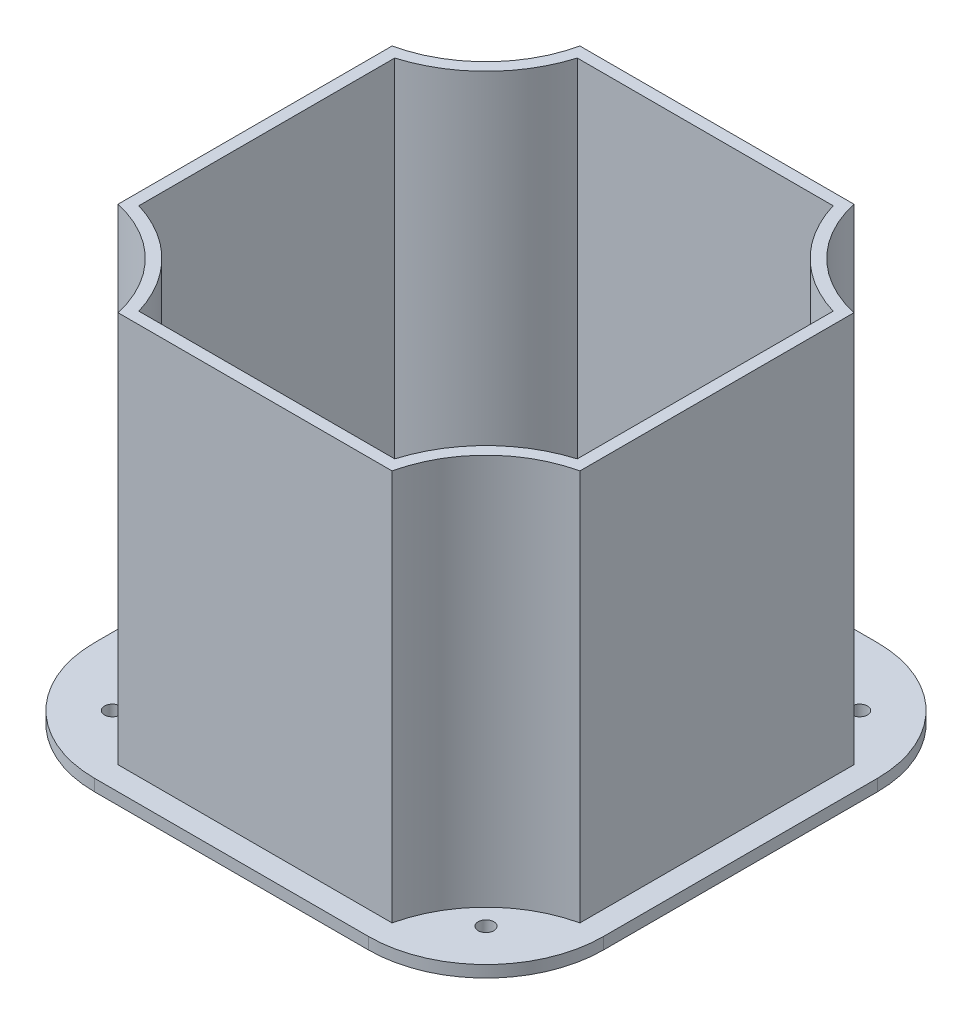
ISO-10303-21;
HEADER;
FILE_DESCRIPTION(('STEP AP214'),'2;1');
FILE_NAME('part.step','',(''),(''),'','','');
FILE_SCHEMA(('AUTOMOTIVE_DESIGN { 1 0 10303 214 1 1 1 1 }'));
ENDSEC;
DATA;
#1=APPLICATION_CONTEXT('core data for automotive mechanical design processes');
#2=APPLICATION_PROTOCOL_DEFINITION('international standard','automotive_design',2000,#1);
#3=PRODUCT_CONTEXT('',#1,'mechanical');
#4=PRODUCT('Part','Part','',(#3));
#5=PRODUCT_RELATED_PRODUCT_CATEGORY('part','',(#4));
#6=PRODUCT_DEFINITION_FORMATION('','',#4);
#7=PRODUCT_DEFINITION_CONTEXT('part definition',#1,'design');
#8=PRODUCT_DEFINITION('design','',#6,#7);
#9=PRODUCT_DEFINITION_SHAPE('','',#8);
#10=(LENGTH_UNIT() NAMED_UNIT(*) SI_UNIT(.MILLI.,.METRE.));
#11=(NAMED_UNIT(*) PLANE_ANGLE_UNIT() SI_UNIT($,.RADIAN.));
#12=(NAMED_UNIT(*) SI_UNIT($,.STERADIAN.) SOLID_ANGLE_UNIT());
#13=UNCERTAINTY_MEASURE_WITH_UNIT(LENGTH_MEASURE(1.E-05),#10,'distance_accuracy_value','');
#14=(GEOMETRIC_REPRESENTATION_CONTEXT(3) GLOBAL_UNCERTAINTY_ASSIGNED_CONTEXT((#13)) GLOBAL_UNIT_ASSIGNED_CONTEXT((#10,
#11,#12)) REPRESENTATION_CONTEXT('',''));
#15=CARTESIAN_POINT('',(0.,0.,0.));
#16=DIRECTION('',(0.,0.,1.));
#17=DIRECTION('',(1.,0.,0.));
#18=AXIS2_PLACEMENT_3D('',#15,#16,#17);
#19=CARTESIAN_POINT('',(18.535245878062,1.5,16.1689695853489));
#20=DIRECTION('',(0.,1.,0.));
#21=DIRECTION('',(0.,0.,1.));
#22=AXIS2_PLACEMENT_3D('',#19,#20,#21);
#23=PLANE('',#22);
#24=CARTESIAN_POINT('',(-22.8287151526167,1.5,-25.1949914453303));
#25=DIRECTION('',(0.,1.,0.));
#26=DIRECTION('',(0.,0.,1.));
#27=AXIS2_PLACEMENT_3D('',#24,#25,#26);
#28=CIRCLE('',#27,1.);
#29=CARTESIAN_POINT('',(-22.8287151526167,1.5,-24.1949914453303));
#30=VERTEX_POINT('',#29);
#31=EDGE_CURVE('E225',#30,#30,#28,.T.);
#32=ORIENTED_EDGE('',*,*,#31,.F.);
#33=EDGE_LOOP('',(#32));
#34=FACE_BOUND('',#33,.T.);
#35=CARTESIAN_POINT('',(24.8992069087408,1.5,22.5329306160279));
#36=DIRECTION('',(0.,1.,0.));
#37=DIRECTION('',(0.,0.,1.));
#38=AXIS2_PLACEMENT_3D('',#35,#36,#37);
#39=CIRCLE('',#38,1.);
#40=CARTESIAN_POINT('',(24.8992069087408,1.5,23.5329306160279));
#41=VERTEX_POINT('',#40);
#42=EDGE_CURVE('E215',#41,#41,#39,.T.);
#43=ORIENTED_EDGE('',*,*,#42,.F.);
#44=EDGE_LOOP('',(#43));
#45=FACE_BOUND('',#44,.T.);
#46=CARTESIAN_POINT('',(18.535245878062,1.5,16.1689695853489));
#47=DIRECTION('',(0.,1.,0.));
#48=DIRECTION('',(0.,0.,1.));
#49=AXIS2_PLACEMENT_3D('',#46,#47,#48);
#50=CIRCLE('',#49,15.);
#51=CARTESIAN_POINT('',(18.5352458780619,1.5,31.1689695853489));
#52=VERTEX_POINT('',#51);
#53=CARTESIAN_POINT('',(33.535245878062,1.5,16.1689695853488));
#54=VERTEX_POINT('',#53);
#55=EDGE_CURVE('E160',#52,#54,#50,.T.);
#56=ORIENTED_EDGE('',*,*,#55,.T.);
#57=DIRECTION('',(0.,0.,-1.));
#58=VECTOR('',#57,1.);
#59=CARTESIAN_POINT('',(33.535245878062,1.5,16.1689695853488));
#60=LINE('',#59,#58);
#61=CARTESIAN_POINT('',(33.535245878062,1.5,-18.831030414651));
#62=VERTEX_POINT('',#61);
#63=EDGE_CURVE('E103',#54,#62,#60,.T.);
#64=ORIENTED_EDGE('',*,*,#63,.T.);
#65=CARTESIAN_POINT('',(18.535245878062,1.5,-18.8310304146511));
#66=DIRECTION('',(0.,1.,0.));
#67=DIRECTION('',(0.,0.,1.));
#68=AXIS2_PLACEMENT_3D('',#65,#66,#67);
#69=CIRCLE('',#68,15.);
#70=CARTESIAN_POINT('',(18.5352458780619,1.5,-33.8310304146511));
#71=VERTEX_POINT('',#70);
#72=EDGE_CURVE('E175',#62,#71,#69,.T.);
#73=ORIENTED_EDGE('',*,*,#72,.T.);
#74=DIRECTION('',(-1.,0.,0.));
#75=VECTOR('',#74,1.);
#76=CARTESIAN_POINT('',(18.5352458780619,1.5,-33.8310304146511));
#77=LINE('',#76,#75);
#78=CARTESIAN_POINT('',(-16.4647541219379,1.5,-33.8310304146511));
#79=VERTEX_POINT('',#78);
#80=EDGE_CURVE('E188',#71,#79,#77,.T.);
#81=ORIENTED_EDGE('',*,*,#80,.T.);
#82=CARTESIAN_POINT('',(-16.464754121938,1.5,-18.8310304146511));
#83=DIRECTION('',(0.,1.,0.));
#84=DIRECTION('',(0.,0.,1.));
#85=AXIS2_PLACEMENT_3D('',#82,#83,#84);
#86=CIRCLE('',#85,15.);
#87=CARTESIAN_POINT('',(-31.464754121938,1.5,-18.831030414651));
#88=VERTEX_POINT('',#87);
#89=EDGE_CURVE('E124',#79,#88,#86,.T.);
#90=ORIENTED_EDGE('',*,*,#89,.T.);
#91=DIRECTION('',(0.,0.,1.));
#92=VECTOR('',#91,1.);
#93=CARTESIAN_POINT('',(-31.464754121938,1.5,-18.831030414651));
#94=LINE('',#93,#92);
#95=CARTESIAN_POINT('',(-31.464754121938,1.5,16.1689695853488));
#96=VERTEX_POINT('',#95);
#97=EDGE_CURVE('E118',#88,#96,#94,.T.);
#98=ORIENTED_EDGE('',*,*,#97,.T.);
#99=CARTESIAN_POINT('',(-16.464754121938,1.5,16.1689695853489));
#100=DIRECTION('',(0.,1.,0.));
#101=DIRECTION('',(0.,0.,1.));
#102=AXIS2_PLACEMENT_3D('',#99,#100,#101);
#103=CIRCLE('',#102,15.);
#104=CARTESIAN_POINT('',(-16.4647541219379,1.5,31.1689695853489));
#105=VERTEX_POINT('',#104);
#106=EDGE_CURVE('E121',#96,#105,#103,.T.);
#107=ORIENTED_EDGE('',*,*,#106,.T.);
#108=DIRECTION('',(1.,0.,0.));
#109=VECTOR('',#108,1.);
#110=CARTESIAN_POINT('',(-16.4647541219379,1.5,31.1689695853489));
#111=LINE('',#110,#109);
#112=EDGE_CURVE('E62',#105,#52,#111,.T.);
#113=ORIENTED_EDGE('',*,*,#112,.T.);
#114=EDGE_LOOP('',(#56,#64,#73,#81,#90,#98,#107,#113));
#115=FACE_BOUND('',#114,.T.);
#116=DIRECTION('',(0.,0.,-1.));
#117=VECTOR('',#116,1.);
#118=CARTESIAN_POINT('',(30.5352458780619,1.5,16.1689695853489));
#119=LINE('',#118,#117);
#120=CARTESIAN_POINT('',(30.5352458780619,1.5,16.1689695853489));
#121=VERTEX_POINT('',#120);
#122=CARTESIAN_POINT('',(30.535245878062,1.5,-18.831030414651));
#123=VERTEX_POINT('',#122);
#124=EDGE_CURVE('E209',#121,#123,#119,.T.);
#125=ORIENTED_EDGE('',*,*,#124,.F.);
#126=CARTESIAN_POINT('',(34.0017247818063,1.5,31.6354484890935));
#127=DIRECTION('',(0.,-1.,0.));
#128=DIRECTION('',(0.,0.,1.));
#129=AXIS2_PLACEMENT_3D('',#126,#127,#128);
#130=CIRCLE('',#129,15.8501875594606);
#131=CARTESIAN_POINT('',(18.5352458780619,1.5,28.1689695853489));
#132=VERTEX_POINT('',#131);
#133=EDGE_CURVE('E212',#132,#121,#130,.T.);
#134=ORIENTED_EDGE('',*,*,#133,.F.);
#135=DIRECTION('',(1.,0.,0.));
#136=VECTOR('',#135,1.);
#137=CARTESIAN_POINT('',(18.5352458780619,1.5,28.1689695853489));
#138=LINE('',#137,#136);
#139=CARTESIAN_POINT('',(-16.4647541219379,1.5,28.1689695853489));
#140=VERTEX_POINT('',#139);
#141=EDGE_CURVE('E53',#140,#132,#138,.T.);
#142=ORIENTED_EDGE('',*,*,#141,.F.);
#143=CARTESIAN_POINT('',(-31.9312330256827,1.5,31.6354484890931));
#144=DIRECTION('',(0.,-1.,0.));
#145=DIRECTION('',(0.,0.,1.));
#146=AXIS2_PLACEMENT_3D('',#143,#144,#145);
#147=CIRCLE('',#146,15.8501875594606);
#148=CARTESIAN_POINT('',(-28.464754121938,1.5,16.1689695853486));
#149=VERTEX_POINT('',#148);
#150=EDGE_CURVE('E195',#149,#140,#147,.T.);
#151=ORIENTED_EDGE('',*,*,#150,.F.);
#152=DIRECTION('',(0.,0.,1.));
#153=VECTOR('',#152,1.);
#154=CARTESIAN_POINT('',(-28.4647541219379,1.5,-18.8310304146514));
#155=LINE('',#154,#153);
#156=CARTESIAN_POINT('',(-28.4647541219379,1.5,-18.8310304146514));
#157=VERTEX_POINT('',#156);
#158=EDGE_CURVE('E197',#157,#149,#155,.T.);
#159=ORIENTED_EDGE('',*,*,#158,.F.);
#160=CARTESIAN_POINT('',(-31.9312330256821,1.5,-34.297509318396));
#161=DIRECTION('',(0.,-1.,0.));
#162=DIRECTION('',(0.,0.,1.));
#163=AXIS2_PLACEMENT_3D('',#160,#161,#162);
#164=CIRCLE('',#163,15.8501875594605);
#165=CARTESIAN_POINT('',(-16.4647541219378,1.5,-30.8310304146511));
#166=VERTEX_POINT('',#165);
#167=EDGE_CURVE('E200',#166,#157,#164,.T.);
#168=ORIENTED_EDGE('',*,*,#167,.F.);
#169=DIRECTION('',(-1.,0.,0.));
#170=VECTOR('',#169,1.);
#171=CARTESIAN_POINT('',(-16.4647541219379,1.5,-30.8310304146511));
#172=LINE('',#171,#170);
#173=CARTESIAN_POINT('',(18.5352458780619,1.5,-30.8310304146511));
#174=VERTEX_POINT('',#173);
#175=EDGE_CURVE('E203',#174,#166,#172,.T.);
#176=ORIENTED_EDGE('',*,*,#175,.F.);
#177=CARTESIAN_POINT('',(34.0017247818065,1.5,-34.2975093183955));
#178=DIRECTION('',(0.,-1.,0.));
#179=DIRECTION('',(0.,0.,1.));
#180=AXIS2_PLACEMENT_3D('',#177,#178,#179);
#181=CIRCLE('',#180,15.8501875594606);
#182=EDGE_CURVE('E206',#123,#174,#181,.T.);
#183=ORIENTED_EDGE('',*,*,#182,.F.);
#184=EDGE_LOOP('',(#125,#134,#142,#151,#159,#168,#176,#183));
#185=FACE_BOUND('',#184,.T.);
#186=CARTESIAN_POINT('',(-22.8287151526171,1.5,22.5329306160277));
#187=DIRECTION('',(0.,1.,0.));
#188=DIRECTION('',(0.,0.,1.));
#189=AXIS2_PLACEMENT_3D('',#186,#187,#188);
#190=CIRCLE('',#189,1.00000000000001);
#191=CARTESIAN_POINT('',(-22.8287151526171,1.5,23.5329306160277));
#192=VERTEX_POINT('',#191);
#193=EDGE_CURVE('E219',#192,#192,#190,.T.);
#194=ORIENTED_EDGE('',*,*,#193,.F.);
#195=EDGE_LOOP('',(#194));
#196=FACE_BOUND('',#195,.T.);
#197=CARTESIAN_POINT('',(24.8992069087409,1.5,-25.1949914453301));
#198=DIRECTION('',(0.,1.,0.));
#199=DIRECTION('',(0.,0.,1.));
#200=AXIS2_PLACEMENT_3D('',#197,#198,#199);
#201=CIRCLE('',#200,1.);
#202=CARTESIAN_POINT('',(24.8992069087409,1.5,-24.1949914453301));
#203=VERTEX_POINT('',#202);
#204=EDGE_CURVE('E231',#203,#203,#201,.T.);
#205=ORIENTED_EDGE('',*,*,#204,.F.);
#206=EDGE_LOOP('',(#205));
#207=FACE_BOUND('',#206,.T.);
#208=ADVANCED_FACE('F38',(#34,#45,#115,#185,#196,#207),#23,.T.);
#209=CARTESIAN_POINT('',(18.535245878062,0.,16.1689695853489));
#210=DIRECTION('',(0.,1.,0.));
#211=DIRECTION('',(0.,0.,1.));
#212=AXIS2_PLACEMENT_3D('',#209,#210,#211);
#213=PLANE('',#212);
#214=CARTESIAN_POINT('',(18.535245878062,0.,16.1689695853489));
#215=DIRECTION('',(0.,1.,0.));
#216=DIRECTION('',(0.,0.,1.));
#217=AXIS2_PLACEMENT_3D('',#214,#215,#216);
#218=CIRCLE('',#217,15.);
#219=CARTESIAN_POINT('',(18.5352458780619,0.,31.1689695853489));
#220=VERTEX_POINT('',#219);
#221=CARTESIAN_POINT('',(33.535245878062,0.,16.1689695853488));
#222=VERTEX_POINT('',#221);
#223=EDGE_CURVE('E145',#220,#222,#218,.T.);
#224=ORIENTED_EDGE('',*,*,#223,.F.);
#225=DIRECTION('',(1.,0.,0.));
#226=VECTOR('',#225,1.);
#227=CARTESIAN_POINT('',(-16.4647541219379,0.,31.1689695853489));
#228=LINE('',#227,#226);
#229=CARTESIAN_POINT('',(-16.4647541219379,0.,31.1689695853489));
#230=VERTEX_POINT('',#229);
#231=EDGE_CURVE('E95',#230,#220,#228,.T.);
#232=ORIENTED_EDGE('',*,*,#231,.F.);
#233=CARTESIAN_POINT('',(-16.464754121938,0.,16.1689695853489));
#234=DIRECTION('',(0.,1.,0.));
#235=DIRECTION('',(0.,0.,1.));
#236=AXIS2_PLACEMENT_3D('',#233,#234,#235);
#237=CIRCLE('',#236,15.);
#238=CARTESIAN_POINT('',(-31.464754121938,0.,16.1689695853488));
#239=VERTEX_POINT('',#238);
#240=EDGE_CURVE('E157',#239,#230,#237,.T.);
#241=ORIENTED_EDGE('',*,*,#240,.F.);
#242=DIRECTION('',(0.,0.,1.));
#243=VECTOR('',#242,1.);
#244=CARTESIAN_POINT('',(-31.464754121938,0.,-18.831030414651));
#245=LINE('',#244,#243);
#246=CARTESIAN_POINT('',(-31.464754121938,0.,-18.831030414651));
#247=VERTEX_POINT('',#246);
#248=EDGE_CURVE('E133',#247,#239,#245,.T.);
#249=ORIENTED_EDGE('',*,*,#248,.F.);
#250=CARTESIAN_POINT('',(-16.464754121938,0.,-18.8310304146511));
#251=DIRECTION('',(0.,1.,0.));
#252=DIRECTION('',(0.,0.,1.));
#253=AXIS2_PLACEMENT_3D('',#250,#251,#252);
#254=CIRCLE('',#253,15.);
#255=CARTESIAN_POINT('',(-16.4647541219379,0.,-33.8310304146511));
#256=VERTEX_POINT('',#255);
#257=EDGE_CURVE('E154',#256,#247,#254,.T.);
#258=ORIENTED_EDGE('',*,*,#257,.F.);
#259=DIRECTION('',(-1.,0.,0.));
#260=VECTOR('',#259,1.);
#261=CARTESIAN_POINT('',(18.5352458780619,0.,-33.8310304146511));
#262=LINE('',#261,#260);
#263=CARTESIAN_POINT('',(18.5352458780619,0.,-33.8310304146511));
#264=VERTEX_POINT('',#263);
#265=EDGE_CURVE('E152',#264,#256,#262,.T.);
#266=ORIENTED_EDGE('',*,*,#265,.F.);
#267=CARTESIAN_POINT('',(18.535245878062,0.,-18.8310304146511));
#268=DIRECTION('',(0.,1.,0.));
#269=DIRECTION('',(0.,0.,1.));
#270=AXIS2_PLACEMENT_3D('',#267,#268,#269);
#271=CIRCLE('',#270,15.);
#272=CARTESIAN_POINT('',(33.535245878062,0.,-18.831030414651));
#273=VERTEX_POINT('',#272);
#274=EDGE_CURVE('E150',#273,#264,#271,.T.);
#275=ORIENTED_EDGE('',*,*,#274,.F.);
#276=DIRECTION('',(0.,0.,-1.));
#277=VECTOR('',#276,1.);
#278=CARTESIAN_POINT('',(33.535245878062,0.,16.1689695853488));
#279=LINE('',#278,#277);
#280=EDGE_CURVE('E148',#222,#273,#279,.T.);
#281=ORIENTED_EDGE('',*,*,#280,.F.);
#282=EDGE_LOOP('',(#224,#232,#241,#249,#258,#266,#275,#281));
#283=FACE_BOUND('',#282,.T.);
#284=CARTESIAN_POINT('',(24.8992069087408,0.,22.5329306160279));
#285=DIRECTION('',(0.,1.,0.));
#286=DIRECTION('',(0.,0.,1.));
#287=AXIS2_PLACEMENT_3D('',#284,#285,#286);
#288=CIRCLE('',#287,1.);
#289=CARTESIAN_POINT('',(24.8992069087408,0.,23.5329306160279));
#290=VERTEX_POINT('',#289);
#291=EDGE_CURVE('E216',#290,#290,#288,.T.);
#292=ORIENTED_EDGE('',*,*,#291,.T.);
#293=EDGE_LOOP('',(#292));
#294=FACE_BOUND('',#293,.T.);
#295=CARTESIAN_POINT('',(-22.8287151526171,0.,22.5329306160277));
#296=DIRECTION('',(0.,1.,0.));
#297=DIRECTION('',(0.,0.,1.));
#298=AXIS2_PLACEMENT_3D('',#295,#296,#297);
#299=CIRCLE('',#298,1.00000000000001);
#300=CARTESIAN_POINT('',(-22.8287151526171,0.,23.5329306160277));
#301=VERTEX_POINT('',#300);
#302=EDGE_CURVE('E222',#301,#301,#299,.T.);
#303=ORIENTED_EDGE('',*,*,#302,.T.);
#304=EDGE_LOOP('',(#303));
#305=FACE_BOUND('',#304,.T.);
#306=CARTESIAN_POINT('',(-22.8287151526167,0.,-25.1949914453303));
#307=DIRECTION('',(0.,1.,0.));
#308=DIRECTION('',(0.,0.,1.));
#309=AXIS2_PLACEMENT_3D('',#306,#307,#308);
#310=CIRCLE('',#309,1.);
#311=CARTESIAN_POINT('',(-22.8287151526167,0.,-24.1949914453303));
#312=VERTEX_POINT('',#311);
#313=EDGE_CURVE('E228',#312,#312,#310,.T.);
#314=ORIENTED_EDGE('',*,*,#313,.T.);
#315=EDGE_LOOP('',(#314));
#316=FACE_BOUND('',#315,.T.);
#317=CARTESIAN_POINT('',(24.8992069087409,0.,-25.1949914453301));
#318=DIRECTION('',(0.,1.,0.));
#319=DIRECTION('',(0.,0.,1.));
#320=AXIS2_PLACEMENT_3D('',#317,#318,#319);
#321=CIRCLE('',#320,1.);
#322=CARTESIAN_POINT('',(24.8992069087409,0.,-24.1949914453301));
#323=VERTEX_POINT('',#322);
#324=EDGE_CURVE('E234',#323,#323,#321,.T.);
#325=ORIENTED_EDGE('',*,*,#324,.T.);
#326=EDGE_LOOP('',(#325));
#327=FACE_BOUND('',#326,.T.);
#328=DIRECTION('',(0.,0.,1.));
#329=VECTOR('',#328,1.);
#330=CARTESIAN_POINT('',(29.0352458780619,0.,15.0112764601735));
#331=LINE('',#330,#329);
#332=CARTESIAN_POINT('',(29.035245878062,0.,-17.6733372894756));
#333=VERTEX_POINT('',#332);
#334=CARTESIAN_POINT('',(29.0352458780619,0.,15.0112764601735));
#335=VERTEX_POINT('',#334);
#336=EDGE_CURVE('E336',#333,#335,#331,.T.);
#337=ORIENTED_EDGE('',*,*,#336,.F.);
#338=CARTESIAN_POINT('',(34.0017247818065,0.,-34.2975093183955));
#339=DIRECTION('',(0.,1.,0.));
#340=DIRECTION('',(0.,0.,1.));
#341=AXIS2_PLACEMENT_3D('',#338,#339,#340);
#342=CIRCLE('',#341,17.3501875594607);
#343=CARTESIAN_POINT('',(17.3775527528865,0.,-29.3310304146511));
#344=VERTEX_POINT('',#343);
#345=EDGE_CURVE('E335',#344,#333,#342,.T.);
#346=ORIENTED_EDGE('',*,*,#345,.F.);
#347=DIRECTION('',(1.,0.,0.));
#348=VECTOR('',#347,1.);
#349=CARTESIAN_POINT('',(17.3775527528865,0.,-29.3310304146511));
#350=LINE('',#349,#348);
#351=CARTESIAN_POINT('',(-15.3070609967623,0.,-29.3310304146511));
#352=VERTEX_POINT('',#351);
#353=EDGE_CURVE('E354',#352,#344,#350,.T.);
#354=ORIENTED_EDGE('',*,*,#353,.F.);
#355=CARTESIAN_POINT('',(-31.9312330256821,0.,-34.297509318396));
#356=DIRECTION('',(0.,1.,0.));
#357=DIRECTION('',(0.,0.,1.));
#358=AXIS2_PLACEMENT_3D('',#355,#356,#357);
#359=CIRCLE('',#358,17.3501875594606);
#360=CARTESIAN_POINT('',(-26.9647541219379,0.,-17.673337289476));
#361=VERTEX_POINT('',#360);
#362=EDGE_CURVE('E351',#361,#352,#359,.T.);
#363=ORIENTED_EDGE('',*,*,#362,.F.);
#364=DIRECTION('',(0.,0.,-1.));
#365=VECTOR('',#364,1.);
#366=CARTESIAN_POINT('',(-26.9647541219379,0.,-17.673337289476));
#367=LINE('',#366,#365);
#368=CARTESIAN_POINT('',(-26.964754121938,0.,15.0112764601731));
#369=VERTEX_POINT('',#368);
#370=EDGE_CURVE('E348',#369,#361,#367,.T.);
#371=ORIENTED_EDGE('',*,*,#370,.F.);
#372=CARTESIAN_POINT('',(-31.9312330256827,0.,31.6354484890931));
#373=DIRECTION('',(0.,1.,0.));
#374=DIRECTION('',(0.,0.,1.));
#375=AXIS2_PLACEMENT_3D('',#372,#373,#374);
#376=CIRCLE('',#375,17.3501875594608);
#377=CARTESIAN_POINT('',(-15.3070609967626,0.,26.6689695853489));
#378=VERTEX_POINT('',#377);
#379=EDGE_CURVE('E345',#378,#369,#376,.T.);
#380=ORIENTED_EDGE('',*,*,#379,.F.);
#381=DIRECTION('',(-1.,0.,0.));
#382=VECTOR('',#381,1.);
#383=CARTESIAN_POINT('',(-15.3070609967626,0.,26.6689695853489));
#384=LINE('',#383,#382);
#385=CARTESIAN_POINT('',(17.3775527528864,0.,26.6689695853489));
#386=VERTEX_POINT('',#385);
#387=EDGE_CURVE('E342',#386,#378,#384,.T.);
#388=ORIENTED_EDGE('',*,*,#387,.F.);
#389=CARTESIAN_POINT('',(34.0017247818063,0.,31.6354484890935));
#390=DIRECTION('',(0.,1.,0.));
#391=DIRECTION('',(0.,0.,1.));
#392=AXIS2_PLACEMENT_3D('',#389,#390,#391);
#393=CIRCLE('',#392,17.3501875594606);
#394=EDGE_CURVE('E339',#335,#386,#393,.T.);
#395=ORIENTED_EDGE('',*,*,#394,.F.);
#396=EDGE_LOOP('',(#337,#346,#354,#363,#371,#380,#388,#395));
#397=FACE_BOUND('',#396,.T.);
#398=ADVANCED_FACE('F179',(#283,#294,#305,#316,#327,#397),#213,.F.);
#399=CARTESIAN_POINT('',(18.535245878062,1.5,16.1689695853489));
#400=DIRECTION('',(0.,-1.,0.));
#401=DIRECTION('',(0.,0.,-1.));
#402=AXIS2_PLACEMENT_3D('',#399,#400,#401);
#403=CYLINDRICAL_SURFACE('',#402,15.);
#404=ORIENTED_EDGE('',*,*,#223,.T.);
#405=DIRECTION('',(0.,-1.,0.));
#406=VECTOR('',#405,1.);
#407=CARTESIAN_POINT('',(33.535245878062,1.5,16.1689695853488));
#408=LINE('',#407,#406);
#409=EDGE_CURVE('E11',#54,#222,#408,.T.);
#410=ORIENTED_EDGE('',*,*,#409,.F.);
#411=ORIENTED_EDGE('',*,*,#55,.F.);
#412=DIRECTION('',(0.,-1.,0.));
#413=VECTOR('',#412,1.);
#414=CARTESIAN_POINT('',(18.5352458780619,1.5,31.1689695853489));
#415=LINE('',#414,#413);
#416=EDGE_CURVE('E141',#52,#220,#415,.T.);
#417=ORIENTED_EDGE('',*,*,#416,.T.);
#418=EDGE_LOOP('',(#404,#410,#411,#417));
#419=FACE_BOUND('',#418,.T.);
#420=ADVANCED_FACE('F40',(#419),#403,.T.);
#421=CARTESIAN_POINT('',(33.535245878062,1.5,16.1689695853488));
#422=DIRECTION('',(-1.,0.,0.));
#423=DIRECTION('',(0.,0.,1.));
#424=AXIS2_PLACEMENT_3D('',#421,#422,#423);
#425=PLANE('',#424);
#426=ORIENTED_EDGE('',*,*,#280,.T.);
#427=DIRECTION('',(0.,-1.,0.));
#428=VECTOR('',#427,1.);
#429=CARTESIAN_POINT('',(33.535245878062,1.5,-18.831030414651));
#430=LINE('',#429,#428);
#431=EDGE_CURVE('E46',#62,#273,#430,.T.);
#432=ORIENTED_EDGE('',*,*,#431,.F.);
#433=ORIENTED_EDGE('',*,*,#63,.F.);
#434=ORIENTED_EDGE('',*,*,#409,.T.);
#435=EDGE_LOOP('',(#426,#432,#433,#434));
#436=FACE_BOUND('',#435,.T.);
#437=ADVANCED_FACE('F530',(#436),#425,.F.);
#438=CARTESIAN_POINT('',(18.535245878062,1.5,-18.8310304146511));
#439=DIRECTION('',(0.,-1.,0.));
#440=DIRECTION('',(0.,0.,-1.));
#441=AXIS2_PLACEMENT_3D('',#438,#439,#440);
#442=CYLINDRICAL_SURFACE('',#441,15.);
#443=ORIENTED_EDGE('',*,*,#274,.T.);
#444=DIRECTION('',(0.,-1.,0.));
#445=VECTOR('',#444,1.);
#446=CARTESIAN_POINT('',(18.5352458780619,1.5,-33.8310304146511));
#447=LINE('',#446,#445);
#448=EDGE_CURVE('E167',#71,#264,#447,.T.);
#449=ORIENTED_EDGE('',*,*,#448,.F.);
#450=ORIENTED_EDGE('',*,*,#72,.F.);
#451=ORIENTED_EDGE('',*,*,#431,.T.);
#452=EDGE_LOOP('',(#443,#449,#450,#451));
#453=FACE_BOUND('',#452,.T.);
#454=ADVANCED_FACE('F173',(#453),#442,.T.);
#455=CARTESIAN_POINT('',(18.5352458780619,1.5,-33.8310304146511));
#456=DIRECTION('',(0.,0.,1.));
#457=DIRECTION('',(1.,0.,0.));
#458=AXIS2_PLACEMENT_3D('',#455,#456,#457);
#459=PLANE('',#458);
#460=ORIENTED_EDGE('',*,*,#265,.T.);
#461=DIRECTION('',(0.,-1.,0.));
#462=VECTOR('',#461,1.);
#463=CARTESIAN_POINT('',(-16.4647541219379,1.5,-33.8310304146511));
#464=LINE('',#463,#462);
#465=EDGE_CURVE('E164',#79,#256,#464,.T.);
#466=ORIENTED_EDGE('',*,*,#465,.F.);
#467=ORIENTED_EDGE('',*,*,#80,.F.);
#468=ORIENTED_EDGE('',*,*,#448,.T.);
#469=EDGE_LOOP('',(#460,#466,#467,#468));
#470=FACE_BOUND('',#469,.T.);
#471=ADVANCED_FACE('F184',(#470),#459,.F.);
#472=CARTESIAN_POINT('',(-16.464754121938,1.5,-18.8310304146511));
#473=DIRECTION('',(0.,-1.,0.));
#474=DIRECTION('',(0.,0.,-1.));
#475=AXIS2_PLACEMENT_3D('',#472,#473,#474);
#476=CYLINDRICAL_SURFACE('',#475,15.);
#477=ORIENTED_EDGE('',*,*,#257,.T.);
#478=DIRECTION('',(0.,-1.,0.));
#479=VECTOR('',#478,1.);
#480=CARTESIAN_POINT('',(-31.464754121938,1.5,-18.831030414651));
#481=LINE('',#480,#479);
#482=EDGE_CURVE('E136',#88,#247,#481,.T.);
#483=ORIENTED_EDGE('',*,*,#482,.F.);
#484=ORIENTED_EDGE('',*,*,#89,.F.);
#485=ORIENTED_EDGE('',*,*,#465,.T.);
#486=EDGE_LOOP('',(#477,#483,#484,#485));
#487=FACE_BOUND('',#486,.T.);
#488=ADVANCED_FACE('F187',(#487),#476,.T.);
#489=CARTESIAN_POINT('',(-31.464754121938,1.5,-18.831030414651));
#490=DIRECTION('',(1.,0.,0.));
#491=DIRECTION('',(0.,0.,-1.));
#492=AXIS2_PLACEMENT_3D('',#489,#490,#491);
#493=PLANE('',#492);
#494=ORIENTED_EDGE('',*,*,#248,.T.);
#495=DIRECTION('',(0.,-1.,0.));
#496=VECTOR('',#495,1.);
#497=CARTESIAN_POINT('',(-31.464754121938,1.5,16.1689695853488));
#498=LINE('',#497,#496);
#499=EDGE_CURVE('E130',#96,#239,#498,.T.);
#500=ORIENTED_EDGE('',*,*,#499,.F.);
#501=ORIENTED_EDGE('',*,*,#97,.F.);
#502=ORIENTED_EDGE('',*,*,#482,.T.);
#503=EDGE_LOOP('',(#494,#500,#501,#502));
#504=FACE_BOUND('',#503,.T.);
#505=ADVANCED_FACE('F131',(#504),#493,.F.);
#506=CARTESIAN_POINT('',(-16.464754121938,1.5,16.1689695853489));
#507=DIRECTION('',(0.,-1.,0.));
#508=DIRECTION('',(0.,0.,-1.));
#509=AXIS2_PLACEMENT_3D('',#506,#507,#508);
#510=CYLINDRICAL_SURFACE('',#509,15.);
#511=ORIENTED_EDGE('',*,*,#240,.T.);
#512=DIRECTION('',(0.,-1.,0.));
#513=VECTOR('',#512,1.);
#514=CARTESIAN_POINT('',(-16.4647541219379,1.5,31.1689695853489));
#515=LINE('',#514,#513);
#516=EDGE_CURVE('E137',#105,#230,#515,.T.);
#517=ORIENTED_EDGE('',*,*,#516,.F.);
#518=ORIENTED_EDGE('',*,*,#106,.F.);
#519=ORIENTED_EDGE('',*,*,#499,.T.);
#520=EDGE_LOOP('',(#511,#517,#518,#519));
#521=FACE_BOUND('',#520,.T.);
#522=ADVANCED_FACE('F139',(#521),#510,.T.);
#523=CARTESIAN_POINT('',(-16.4647541219379,1.5,31.1689695853489));
#524=DIRECTION('',(0.,0.,-1.));
#525=DIRECTION('',(-1.,0.,0.));
#526=AXIS2_PLACEMENT_3D('',#523,#524,#525);
#527=PLANE('',#526);
#528=ORIENTED_EDGE('',*,*,#231,.T.);
#529=ORIENTED_EDGE('',*,*,#416,.F.);
#530=ORIENTED_EDGE('',*,*,#112,.F.);
#531=ORIENTED_EDGE('',*,*,#516,.T.);
#532=EDGE_LOOP('',(#528,#529,#530,#531));
#533=FACE_BOUND('',#532,.T.);
#534=ADVANCED_FACE('F518',(#533),#527,.F.);
#535=CARTESIAN_POINT('',(24.8992069087408,1.5,22.5329306160279));
#536=DIRECTION('',(0.,-1.,0.));
#537=DIRECTION('',(0.,0.,-1.));
#538=AXIS2_PLACEMENT_3D('',#535,#536,#537);
#539=CYLINDRICAL_SURFACE('',#538,1.);
#540=ORIENTED_EDGE('',*,*,#42,.T.);
#541=EDGE_LOOP('',(#540));
#542=FACE_BOUND('',#541,.T.);
#543=ORIENTED_EDGE('',*,*,#291,.F.);
#544=EDGE_LOOP('',(#543));
#545=FACE_BOUND('',#544,.T.);
#546=ADVANCED_FACE('F515',(#542,#545),#539,.F.);
#547=CARTESIAN_POINT('',(-22.8287151526171,1.5,22.5329306160277));
#548=DIRECTION('',(0.,-1.,0.));
#549=DIRECTION('',(0.,0.,-1.));
#550=AXIS2_PLACEMENT_3D('',#547,#548,#549);
#551=CYLINDRICAL_SURFACE('',#550,1.00000000000001);
#552=ORIENTED_EDGE('',*,*,#193,.T.);
#553=EDGE_LOOP('',(#552));
#554=FACE_BOUND('',#553,.T.);
#555=ORIENTED_EDGE('',*,*,#302,.F.);
#556=EDGE_LOOP('',(#555));
#557=FACE_BOUND('',#556,.T.);
#558=ADVANCED_FACE('F575',(#554,#557),#551,.F.);
#559=CARTESIAN_POINT('',(-22.8287151526167,1.5,-25.1949914453303));
#560=DIRECTION('',(0.,-1.,0.));
#561=DIRECTION('',(0.,0.,-1.));
#562=AXIS2_PLACEMENT_3D('',#559,#560,#561);
#563=CYLINDRICAL_SURFACE('',#562,1.);
#564=ORIENTED_EDGE('',*,*,#31,.T.);
#565=EDGE_LOOP('',(#564));
#566=FACE_BOUND('',#565,.T.);
#567=ORIENTED_EDGE('',*,*,#313,.F.);
#568=EDGE_LOOP('',(#567));
#569=FACE_BOUND('',#568,.T.);
#570=ADVANCED_FACE('F563',(#566,#569),#563,.F.);
#571=CARTESIAN_POINT('',(24.8992069087409,1.5,-25.1949914453301));
#572=DIRECTION('',(0.,-1.,0.));
#573=DIRECTION('',(0.,0.,-1.));
#574=AXIS2_PLACEMENT_3D('',#571,#572,#573);
#575=CYLINDRICAL_SURFACE('',#574,1.);
#576=ORIENTED_EDGE('',*,*,#204,.T.);
#577=EDGE_LOOP('',(#576));
#578=FACE_BOUND('',#577,.T.);
#579=ORIENTED_EDGE('',*,*,#324,.F.);
#580=EDGE_LOOP('',(#579));
#581=FACE_BOUND('',#580,.T.);
#582=ADVANCED_FACE('F557',(#578,#581),#575,.F.);
#583=CARTESIAN_POINT('',(-31.9312330256821,51.5,-34.297509318396));
#584=DIRECTION('',(0.,1.,0.));
#585=DIRECTION('',(0.,0.,1.));
#586=AXIS2_PLACEMENT_3D('',#583,#584,#585);
#587=PLANE('',#586);
#588=CARTESIAN_POINT('',(-31.9312330256821,51.5,-34.297509318396));
#589=DIRECTION('',(0.,-1.,0.));
#590=DIRECTION('',(0.,0.,1.));
#591=AXIS2_PLACEMENT_3D('',#588,#589,#590);
#592=CIRCLE('',#591,15.8501875594606);
#593=CARTESIAN_POINT('',(-16.4647541219378,51.5,-30.8310304146511));
#594=VERTEX_POINT('',#593);
#595=CARTESIAN_POINT('',(-28.4647541219379,51.5,-18.8310304146514));
#596=VERTEX_POINT('',#595);
#597=EDGE_CURVE('E284',#594,#596,#592,.T.);
#598=ORIENTED_EDGE('',*,*,#597,.T.);
#599=DIRECTION('',(0.,0.,1.));
#600=VECTOR('',#599,1.);
#601=CARTESIAN_POINT('',(-28.4647541219379,51.5,-18.8310304146514));
#602=LINE('',#601,#600);
#603=CARTESIAN_POINT('',(-28.464754121938,51.5,16.1689695853486));
#604=VERTEX_POINT('',#603);
#605=EDGE_CURVE('E281',#596,#604,#602,.T.);
#606=ORIENTED_EDGE('',*,*,#605,.T.);
#607=CARTESIAN_POINT('',(-31.9312330256827,51.5,31.6354484890931));
#608=DIRECTION('',(0.,-1.,0.));
#609=DIRECTION('',(0.,0.,1.));
#610=AXIS2_PLACEMENT_3D('',#607,#608,#609);
#611=CIRCLE('',#610,15.8501875594607);
#612=CARTESIAN_POINT('',(-16.464754121938,51.5,28.1689695853489));
#613=VERTEX_POINT('',#612);
#614=EDGE_CURVE('E278',#604,#613,#611,.T.);
#615=ORIENTED_EDGE('',*,*,#614,.T.);
#616=DIRECTION('',(1.,0.,0.));
#617=VECTOR('',#616,1.);
#618=CARTESIAN_POINT('',(-16.4647541219379,51.5,28.1689695853489));
#619=LINE('',#618,#617);
#620=CARTESIAN_POINT('',(18.5352458780619,51.5,28.1689695853489));
#621=VERTEX_POINT('',#620);
#622=EDGE_CURVE('E275',#613,#621,#619,.T.);
#623=ORIENTED_EDGE('',*,*,#622,.T.);
#624=CARTESIAN_POINT('',(34.0017247818063,51.5,31.6354484890935));
#625=DIRECTION('',(0.,-1.,0.));
#626=DIRECTION('',(0.,0.,1.));
#627=AXIS2_PLACEMENT_3D('',#624,#625,#626);
#628=CIRCLE('',#627,15.8501875594606);
#629=CARTESIAN_POINT('',(30.5352458780619,51.5,16.168969585349));
#630=VERTEX_POINT('',#629);
#631=EDGE_CURVE('E272',#621,#630,#628,.T.);
#632=ORIENTED_EDGE('',*,*,#631,.T.);
#633=DIRECTION('',(0.,0.,-1.));
#634=VECTOR('',#633,1.);
#635=CARTESIAN_POINT('',(30.5352458780619,51.5,16.1689695853489));
#636=LINE('',#635,#634);
#637=CARTESIAN_POINT('',(30.535245878062,51.5,-18.831030414651));
#638=VERTEX_POINT('',#637);
#639=EDGE_CURVE('E269',#630,#638,#636,.T.);
#640=ORIENTED_EDGE('',*,*,#639,.T.);
#641=CARTESIAN_POINT('',(34.0017247818065,51.5,-34.2975093183955));
#642=DIRECTION('',(0.,-1.,0.));
#643=DIRECTION('',(0.,0.,1.));
#644=AXIS2_PLACEMENT_3D('',#641,#642,#643);
#645=CIRCLE('',#644,15.8501875594607);
#646=CARTESIAN_POINT('',(18.5352458780619,51.5,-30.8310304146511));
#647=VERTEX_POINT('',#646);
#648=EDGE_CURVE('E266',#638,#647,#645,.T.);
#649=ORIENTED_EDGE('',*,*,#648,.T.);
#650=DIRECTION('',(-1.,0.,0.));
#651=VECTOR('',#650,1.);
#652=CARTESIAN_POINT('',(18.5352458780619,51.5,-30.8310304146511));
#653=LINE('',#652,#651);
#654=EDGE_CURVE('E263',#647,#594,#653,.T.);
#655=ORIENTED_EDGE('',*,*,#654,.T.);
#656=EDGE_LOOP('',(#598,#606,#615,#623,#632,#640,#649,#655));
#657=FACE_BOUND('',#656,.T.);
#658=DIRECTION('',(0.,0.,-1.));
#659=VECTOR('',#658,1.);
#660=CARTESIAN_POINT('',(29.0352458780619,51.5,15.0112764601735));
#661=LINE('',#660,#659);
#662=CARTESIAN_POINT('',(29.0352458780619,51.5,15.0112764601735));
#663=VERTEX_POINT('',#662);
#664=CARTESIAN_POINT('',(29.035245878062,51.5,-17.6733372894756));
#665=VERTEX_POINT('',#664);
#666=EDGE_CURVE('E329',#663,#665,#661,.T.);
#667=ORIENTED_EDGE('',*,*,#666,.F.);
#668=CARTESIAN_POINT('',(34.0017247818063,51.5,31.6354484890935));
#669=DIRECTION('',(0.,-1.,0.));
#670=DIRECTION('',(0.,0.,1.));
#671=AXIS2_PLACEMENT_3D('',#668,#669,#670);
#672=CIRCLE('',#671,17.3501875594606);
#673=CARTESIAN_POINT('',(17.3775527528864,51.5,26.6689695853489));
#674=VERTEX_POINT('',#673);
#675=EDGE_CURVE('E332',#674,#663,#672,.T.);
#676=ORIENTED_EDGE('',*,*,#675,.F.);
#677=DIRECTION('',(1.,0.,0.));
#678=VECTOR('',#677,1.);
#679=CARTESIAN_POINT('',(-15.3070609967626,51.5,26.6689695853489));
#680=LINE('',#679,#678);
#681=CARTESIAN_POINT('',(-15.3070609967626,51.5,26.6689695853489));
#682=VERTEX_POINT('',#681);
#683=EDGE_CURVE('E311',#682,#674,#680,.T.);
#684=ORIENTED_EDGE('',*,*,#683,.F.);
#685=CARTESIAN_POINT('',(-31.9312330256827,51.5,31.6354484890931));
#686=DIRECTION('',(0.,-1.,0.));
#687=DIRECTION('',(0.,0.,1.));
#688=AXIS2_PLACEMENT_3D('',#685,#686,#687);
#689=CIRCLE('',#688,17.3501875594608);
#690=CARTESIAN_POINT('',(-26.964754121938,51.5,15.0112764601731));
#691=VERTEX_POINT('',#690);
#692=EDGE_CURVE('E314',#691,#682,#689,.T.);
#693=ORIENTED_EDGE('',*,*,#692,.F.);
#694=DIRECTION('',(0.,0.,1.));
#695=VECTOR('',#694,1.);
#696=CARTESIAN_POINT('',(-26.9647541219379,51.5,-17.673337289476));
#697=LINE('',#696,#695);
#698=CARTESIAN_POINT('',(-26.9647541219379,51.5,-17.673337289476));
#699=VERTEX_POINT('',#698);
#700=EDGE_CURVE('E317',#699,#691,#697,.T.);
#701=ORIENTED_EDGE('',*,*,#700,.F.);
#702=CARTESIAN_POINT('',(-31.9312330256821,51.5,-34.297509318396));
#703=DIRECTION('',(0.,-1.,0.));
#704=DIRECTION('',(0.,0.,1.));
#705=AXIS2_PLACEMENT_3D('',#702,#703,#704);
#706=CIRCLE('',#705,17.3501875594606);
#707=CARTESIAN_POINT('',(-15.3070609967623,51.5,-29.3310304146511));
#708=VERTEX_POINT('',#707);
#709=EDGE_CURVE('E320',#708,#699,#706,.T.);
#710=ORIENTED_EDGE('',*,*,#709,.F.);
#711=DIRECTION('',(-1.,0.,0.));
#712=VECTOR('',#711,1.);
#713=CARTESIAN_POINT('',(17.3775527528865,51.5,-29.3310304146511));
#714=LINE('',#713,#712);
#715=CARTESIAN_POINT('',(17.3775527528865,51.5,-29.3310304146511));
#716=VERTEX_POINT('',#715);
#717=EDGE_CURVE('E323',#716,#708,#714,.T.);
#718=ORIENTED_EDGE('',*,*,#717,.F.);
#719=CARTESIAN_POINT('',(34.0017247818065,51.5,-34.2975093183955));
#720=DIRECTION('',(0.,-1.,0.));
#721=DIRECTION('',(0.,0.,1.));
#722=AXIS2_PLACEMENT_3D('',#719,#720,#721);
#723=CIRCLE('',#722,17.3501875594607);
#724=EDGE_CURVE('E326',#665,#716,#723,.T.);
#725=ORIENTED_EDGE('',*,*,#724,.F.);
#726=EDGE_LOOP('',(#667,#676,#684,#693,#701,#710,#718,#725));
#727=FACE_BOUND('',#726,.T.);
#728=ADVANCED_FACE('F393',(#657,#727),#587,.T.);
#729=CARTESIAN_POINT('',(-31.9312330256821,51.5,-34.297509318396));
#730=DIRECTION('',(0.,-1.,0.));
#731=DIRECTION('',(0.,0.,-1.));
#732=AXIS2_PLACEMENT_3D('',#729,#730,#731);
#733=CYLINDRICAL_SURFACE('',#732,15.8501875594606);
#734=ORIENTED_EDGE('',*,*,#167,.T.);
#735=DIRECTION('',(0.,-1.,0.));
#736=VECTOR('',#735,1.);
#737=CARTESIAN_POINT('',(-28.4647541219379,51.5,-18.8310304146514));
#738=LINE('',#737,#736);
#739=EDGE_CURVE('E237',#596,#157,#738,.T.);
#740=ORIENTED_EDGE('',*,*,#739,.F.);
#741=ORIENTED_EDGE('',*,*,#597,.F.);
#742=DIRECTION('',(0.,-1.,0.));
#743=VECTOR('',#742,1.);
#744=CARTESIAN_POINT('',(-16.4647541219378,51.5,-30.8310304146511));
#745=LINE('',#744,#743);
#746=EDGE_CURVE('E260',#594,#166,#745,.T.);
#747=ORIENTED_EDGE('',*,*,#746,.T.);
#748=EDGE_LOOP('',(#734,#740,#741,#747));
#749=FACE_BOUND('',#748,.T.);
#750=ADVANCED_FACE('F485',(#749),#733,.F.);
#751=CARTESIAN_POINT('',(-28.4647541219379,51.5,-18.8310304146514));
#752=DIRECTION('',(1.,0.,0.));
#753=DIRECTION('',(0.,0.,-1.));
#754=AXIS2_PLACEMENT_3D('',#751,#752,#753);
#755=PLANE('',#754);
#756=ORIENTED_EDGE('',*,*,#158,.T.);
#757=DIRECTION('',(0.,-1.,0.));
#758=VECTOR('',#757,1.);
#759=CARTESIAN_POINT('',(-28.464754121938,51.5,16.1689695853486));
#760=LINE('',#759,#758);
#761=EDGE_CURVE('E242',#604,#149,#760,.T.);
#762=ORIENTED_EDGE('',*,*,#761,.F.);
#763=ORIENTED_EDGE('',*,*,#605,.F.);
#764=ORIENTED_EDGE('',*,*,#739,.T.);
#765=EDGE_LOOP('',(#756,#762,#763,#764));
#766=FACE_BOUND('',#765,.T.);
#767=ADVANCED_FACE('F482',(#766),#755,.F.);
#768=CARTESIAN_POINT('',(-31.9312330256827,51.5,31.6354484890931));
#769=DIRECTION('',(0.,-1.,0.));
#770=DIRECTION('',(0.,0.,-1.));
#771=AXIS2_PLACEMENT_3D('',#768,#769,#770);
#772=CYLINDRICAL_SURFACE('',#771,15.8501875594607);
#773=ORIENTED_EDGE('',*,*,#150,.T.);
#774=DIRECTION('',(0.,-1.,0.));
#775=VECTOR('',#774,1.);
#776=CARTESIAN_POINT('',(-16.464754121938,51.5,28.1689695853489));
#777=LINE('',#776,#775);
#778=EDGE_CURVE('E245',#613,#140,#777,.T.);
#779=ORIENTED_EDGE('',*,*,#778,.F.);
#780=ORIENTED_EDGE('',*,*,#614,.F.);
#781=ORIENTED_EDGE('',*,*,#761,.T.);
#782=EDGE_LOOP('',(#773,#779,#780,#781));
#783=FACE_BOUND('',#782,.T.);
#784=ADVANCED_FACE('F480',(#783),#772,.F.);
#785=CARTESIAN_POINT('',(-16.4647541219379,51.5,28.1689695853489));
#786=DIRECTION('',(0.,0.,-1.));
#787=DIRECTION('',(-1.,0.,0.));
#788=AXIS2_PLACEMENT_3D('',#785,#786,#787);
#789=PLANE('',#788);
#790=ORIENTED_EDGE('',*,*,#141,.T.);
#791=DIRECTION('',(0.,-1.,0.));
#792=VECTOR('',#791,1.);
#793=CARTESIAN_POINT('',(18.5352458780619,51.5,28.1689695853489));
#794=LINE('',#793,#792);
#795=EDGE_CURVE('E248',#621,#132,#794,.T.);
#796=ORIENTED_EDGE('',*,*,#795,.F.);
#797=ORIENTED_EDGE('',*,*,#622,.F.);
#798=ORIENTED_EDGE('',*,*,#778,.T.);
#799=EDGE_LOOP('',(#790,#796,#797,#798));
#800=FACE_BOUND('',#799,.T.);
#801=ADVANCED_FACE('F469',(#800),#789,.F.);
#802=CARTESIAN_POINT('',(34.0017247818063,51.5,31.6354484890935));
#803=DIRECTION('',(0.,-1.,0.));
#804=DIRECTION('',(0.,0.,-1.));
#805=AXIS2_PLACEMENT_3D('',#802,#803,#804);
#806=CYLINDRICAL_SURFACE('',#805,15.8501875594606);
#807=ORIENTED_EDGE('',*,*,#133,.T.);
#808=DIRECTION('',(0.,-1.,0.));
#809=VECTOR('',#808,1.);
#810=CARTESIAN_POINT('',(30.5352458780619,51.5,16.168969585349));
#811=LINE('',#810,#809);
#812=EDGE_CURVE('E251',#630,#121,#811,.T.);
#813=ORIENTED_EDGE('',*,*,#812,.F.);
#814=ORIENTED_EDGE('',*,*,#631,.F.);
#815=ORIENTED_EDGE('',*,*,#795,.T.);
#816=EDGE_LOOP('',(#807,#813,#814,#815));
#817=FACE_BOUND('',#816,.T.);
#818=ADVANCED_FACE('F473',(#817),#806,.F.);
#819=CARTESIAN_POINT('',(30.5352458780619,51.5,16.1689695853489));
#820=DIRECTION('',(-1.,0.,0.));
#821=DIRECTION('',(0.,0.,1.));
#822=AXIS2_PLACEMENT_3D('',#819,#820,#821);
#823=PLANE('',#822);
#824=ORIENTED_EDGE('',*,*,#124,.T.);
#825=DIRECTION('',(0.,-1.,0.));
#826=VECTOR('',#825,1.);
#827=CARTESIAN_POINT('',(30.535245878062,51.5,-18.831030414651));
#828=LINE('',#827,#826);
#829=EDGE_CURVE('E254',#638,#123,#828,.T.);
#830=ORIENTED_EDGE('',*,*,#829,.F.);
#831=ORIENTED_EDGE('',*,*,#639,.F.);
#832=ORIENTED_EDGE('',*,*,#812,.T.);
#833=EDGE_LOOP('',(#824,#830,#831,#832));
#834=FACE_BOUND('',#833,.T.);
#835=ADVANCED_FACE('F496',(#834),#823,.F.);
#836=CARTESIAN_POINT('',(34.0017247818065,51.5,-34.2975093183955));
#837=DIRECTION('',(0.,-1.,0.));
#838=DIRECTION('',(0.,0.,-1.));
#839=AXIS2_PLACEMENT_3D('',#836,#837,#838);
#840=CYLINDRICAL_SURFACE('',#839,15.8501875594607);
#841=ORIENTED_EDGE('',*,*,#182,.T.);
#842=DIRECTION('',(0.,-1.,0.));
#843=VECTOR('',#842,1.);
#844=CARTESIAN_POINT('',(18.5352458780619,51.5,-30.8310304146511));
#845=LINE('',#844,#843);
#846=EDGE_CURVE('E257',#647,#174,#845,.T.);
#847=ORIENTED_EDGE('',*,*,#846,.F.);
#848=ORIENTED_EDGE('',*,*,#648,.F.);
#849=ORIENTED_EDGE('',*,*,#829,.T.);
#850=EDGE_LOOP('',(#841,#847,#848,#849));
#851=FACE_BOUND('',#850,.T.);
#852=ADVANCED_FACE('F493',(#851),#840,.F.);
#853=CARTESIAN_POINT('',(18.5352458780619,51.5,-30.8310304146511));
#854=DIRECTION('',(0.,0.,1.));
#855=DIRECTION('',(1.,0.,0.));
#856=AXIS2_PLACEMENT_3D('',#853,#854,#855);
#857=PLANE('',#856);
#858=ORIENTED_EDGE('',*,*,#175,.T.);
#859=ORIENTED_EDGE('',*,*,#746,.F.);
#860=ORIENTED_EDGE('',*,*,#654,.F.);
#861=ORIENTED_EDGE('',*,*,#846,.T.);
#862=EDGE_LOOP('',(#858,#859,#860,#861));
#863=FACE_BOUND('',#862,.T.);
#864=ADVANCED_FACE('F490',(#863),#857,.F.);
#865=CARTESIAN_POINT('',(34.0017247818063,51.5,31.6354484890935));
#866=DIRECTION('',(0.,-1.,0.));
#867=DIRECTION('',(0.,0.,-1.));
#868=AXIS2_PLACEMENT_3D('',#865,#866,#867);
#869=CYLINDRICAL_SURFACE('',#868,17.3501875594606);
#870=DIRECTION('',(0.,-1.,0.));
#871=VECTOR('',#870,1.);
#872=CARTESIAN_POINT('',(29.0352458780619,51.5,15.0112764601735));
#873=LINE('',#872,#871);
#874=EDGE_CURVE('E287',#663,#335,#873,.T.);
#875=ORIENTED_EDGE('',*,*,#874,.T.);
#876=ORIENTED_EDGE('',*,*,#394,.T.);
#877=DIRECTION('',(0.,-1.,0.));
#878=VECTOR('',#877,1.);
#879=CARTESIAN_POINT('',(17.3775527528864,51.5,26.6689695853489));
#880=LINE('',#879,#878);
#881=EDGE_CURVE('E308',#674,#386,#880,.T.);
#882=ORIENTED_EDGE('',*,*,#881,.F.);
#883=ORIENTED_EDGE('',*,*,#675,.T.);
#884=EDGE_LOOP('',(#875,#876,#882,#883));
#885=FACE_BOUND('',#884,.T.);
#886=ADVANCED_FACE('F422',(#885),#869,.T.);
#887=CARTESIAN_POINT('',(29.0352458780619,51.5,15.0112764601735));
#888=DIRECTION('',(-1.,0.,0.));
#889=DIRECTION('',(0.,0.,1.));
#890=AXIS2_PLACEMENT_3D('',#887,#888,#889);
#891=PLANE('',#890);
#892=DIRECTION('',(0.,-1.,0.));
#893=VECTOR('',#892,1.);
#894=CARTESIAN_POINT('',(29.035245878062,51.5,-17.6733372894756));
#895=LINE('',#894,#893);
#896=EDGE_CURVE('E290',#665,#333,#895,.T.);
#897=ORIENTED_EDGE('',*,*,#896,.T.);
#898=ORIENTED_EDGE('',*,*,#336,.T.);
#899=ORIENTED_EDGE('',*,*,#874,.F.);
#900=ORIENTED_EDGE('',*,*,#666,.T.);
#901=EDGE_LOOP('',(#897,#898,#899,#900));
#902=FACE_BOUND('',#901,.T.);
#903=ADVANCED_FACE('F428',(#902),#891,.T.);
#904=CARTESIAN_POINT('',(34.0017247818065,51.5,-34.2975093183955));
#905=DIRECTION('',(0.,-1.,0.));
#906=DIRECTION('',(0.,0.,-1.));
#907=AXIS2_PLACEMENT_3D('',#904,#905,#906);
#908=CYLINDRICAL_SURFACE('',#907,17.3501875594607);
#909=DIRECTION('',(0.,-1.,0.));
#910=VECTOR('',#909,1.);
#911=CARTESIAN_POINT('',(17.3775527528865,51.5,-29.3310304146511));
#912=LINE('',#911,#910);
#913=EDGE_CURVE('E293',#716,#344,#912,.T.);
#914=ORIENTED_EDGE('',*,*,#913,.T.);
#915=ORIENTED_EDGE('',*,*,#345,.T.);
#916=ORIENTED_EDGE('',*,*,#896,.F.);
#917=ORIENTED_EDGE('',*,*,#724,.T.);
#918=EDGE_LOOP('',(#914,#915,#916,#917));
#919=FACE_BOUND('',#918,.T.);
#920=ADVANCED_FACE('F362',(#919),#908,.T.);
#921=CARTESIAN_POINT('',(17.3775527528865,51.5,-29.3310304146511));
#922=DIRECTION('',(0.,0.,1.));
#923=DIRECTION('',(1.,0.,0.));
#924=AXIS2_PLACEMENT_3D('',#921,#922,#923);
#925=PLANE('',#924);
#926=DIRECTION('',(0.,-1.,0.));
#927=VECTOR('',#926,1.);
#928=CARTESIAN_POINT('',(-15.3070609967623,51.5,-29.3310304146511));
#929=LINE('',#928,#927);
#930=EDGE_CURVE('E296',#708,#352,#929,.T.);
#931=ORIENTED_EDGE('',*,*,#930,.T.);
#932=ORIENTED_EDGE('',*,*,#353,.T.);
#933=ORIENTED_EDGE('',*,*,#913,.F.);
#934=ORIENTED_EDGE('',*,*,#717,.T.);
#935=EDGE_LOOP('',(#931,#932,#933,#934));
#936=FACE_BOUND('',#935,.T.);
#937=ADVANCED_FACE('F377',(#936),#925,.T.);
#938=CARTESIAN_POINT('',(-31.9312330256821,51.5,-34.297509318396));
#939=DIRECTION('',(0.,-1.,0.));
#940=DIRECTION('',(0.,0.,-1.));
#941=AXIS2_PLACEMENT_3D('',#938,#939,#940);
#942=CYLINDRICAL_SURFACE('',#941,17.3501875594606);
#943=DIRECTION('',(0.,-1.,0.));
#944=VECTOR('',#943,1.);
#945=CARTESIAN_POINT('',(-26.9647541219379,51.5,-17.673337289476));
#946=LINE('',#945,#944);
#947=EDGE_CURVE('E299',#699,#361,#946,.T.);
#948=ORIENTED_EDGE('',*,*,#947,.T.);
#949=ORIENTED_EDGE('',*,*,#362,.T.);
#950=ORIENTED_EDGE('',*,*,#930,.F.);
#951=ORIENTED_EDGE('',*,*,#709,.T.);
#952=EDGE_LOOP('',(#948,#949,#950,#951));
#953=FACE_BOUND('',#952,.T.);
#954=ADVANCED_FACE('F386',(#953),#942,.T.);
#955=CARTESIAN_POINT('',(-26.9647541219379,51.5,-17.673337289476));
#956=DIRECTION('',(1.,0.,0.));
#957=DIRECTION('',(0.,0.,-1.));
#958=AXIS2_PLACEMENT_3D('',#955,#956,#957);
#959=PLANE('',#958);
#960=DIRECTION('',(0.,-1.,0.));
#961=VECTOR('',#960,1.);
#962=CARTESIAN_POINT('',(-26.964754121938,51.5,15.0112764601731));
#963=LINE('',#962,#961);
#964=EDGE_CURVE('E302',#691,#369,#963,.T.);
#965=ORIENTED_EDGE('',*,*,#964,.T.);
#966=ORIENTED_EDGE('',*,*,#370,.T.);
#967=ORIENTED_EDGE('',*,*,#947,.F.);
#968=ORIENTED_EDGE('',*,*,#700,.T.);
#969=EDGE_LOOP('',(#965,#966,#967,#968));
#970=FACE_BOUND('',#969,.T.);
#971=ADVANCED_FACE('F400',(#970),#959,.T.);
#972=CARTESIAN_POINT('',(-31.9312330256827,51.5,31.6354484890931));
#973=DIRECTION('',(0.,-1.,0.));
#974=DIRECTION('',(0.,0.,-1.));
#975=AXIS2_PLACEMENT_3D('',#972,#973,#974);
#976=CYLINDRICAL_SURFACE('',#975,17.3501875594608);
#977=DIRECTION('',(0.,-1.,0.));
#978=VECTOR('',#977,1.);
#979=CARTESIAN_POINT('',(-15.3070609967626,51.5,26.6689695853489));
#980=LINE('',#979,#978);
#981=EDGE_CURVE('E305',#682,#378,#980,.T.);
#982=ORIENTED_EDGE('',*,*,#981,.T.);
#983=ORIENTED_EDGE('',*,*,#379,.T.);
#984=ORIENTED_EDGE('',*,*,#964,.F.);
#985=ORIENTED_EDGE('',*,*,#692,.T.);
#986=EDGE_LOOP('',(#982,#983,#984,#985));
#987=FACE_BOUND('',#986,.T.);
#988=ADVANCED_FACE('F406',(#987),#976,.T.);
#989=CARTESIAN_POINT('',(-15.3070609967626,51.5,26.6689695853489));
#990=DIRECTION('',(0.,0.,-1.));
#991=DIRECTION('',(-1.,0.,0.));
#992=AXIS2_PLACEMENT_3D('',#989,#990,#991);
#993=PLANE('',#992);
#994=ORIENTED_EDGE('',*,*,#881,.T.);
#995=ORIENTED_EDGE('',*,*,#387,.T.);
#996=ORIENTED_EDGE('',*,*,#981,.F.);
#997=ORIENTED_EDGE('',*,*,#683,.T.);
#998=EDGE_LOOP('',(#994,#995,#996,#997));
#999=FACE_BOUND('',#998,.T.);
#1000=ADVANCED_FACE('F416',(#999),#993,.T.);
#1001=CLOSED_SHELL('',(#208,#398,#420,#437,#454,#471,#488,#505,#522,#534,#546,#558,#570,#582,
#728,#750,#767,#784,#801,#818,#835,#852,#864,#886,#903,#920,#937,#954,#971,#988,#1000));
#1002=MANIFOLD_SOLID_BREP('B2',#1001);
#1003=ADVANCED_BREP_SHAPE_REPRESENTATION('',(#18,#1002),#14);
#1004=SHAPE_DEFINITION_REPRESENTATION(#9,#1003);
ENDSEC;
END-ISO-10303-21;
